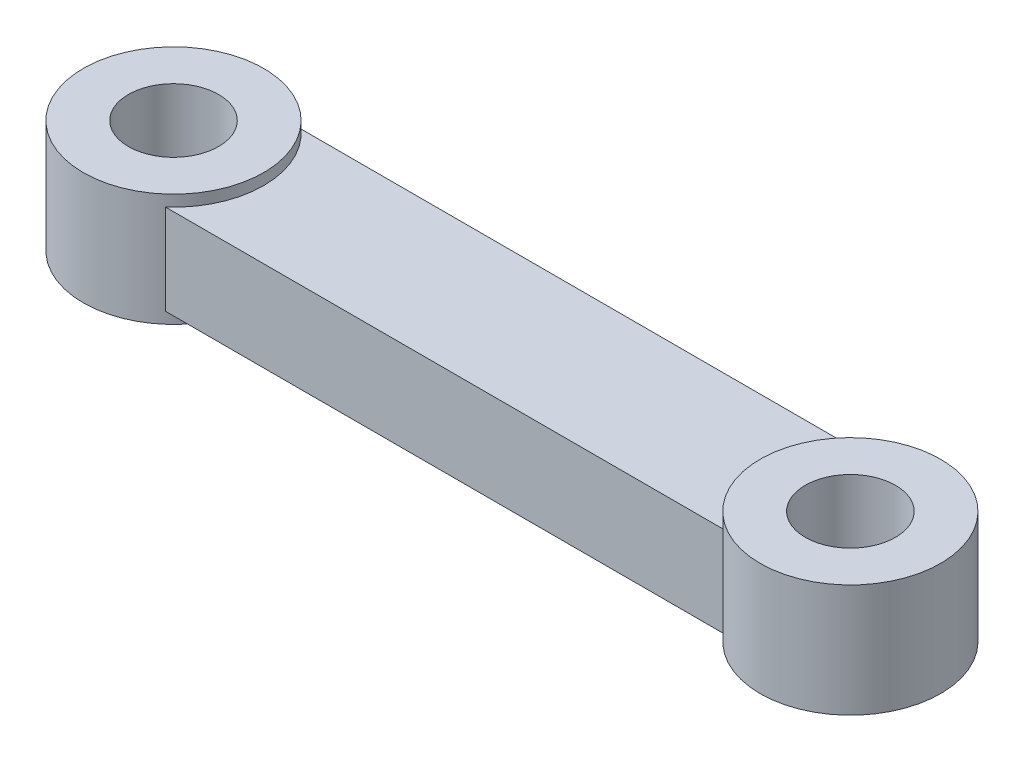
ISO-10303-21;
HEADER;
FILE_DESCRIPTION(('STEP AP214'),'2;1');
FILE_NAME('part.step','',(''),(''),'','','');
FILE_SCHEMA(('AUTOMOTIVE_DESIGN { 1 0 10303 214 1 1 1 1 }'));
ENDSEC;
DATA;
#1=APPLICATION_CONTEXT('core data for automotive mechanical design processes');
#2=APPLICATION_PROTOCOL_DEFINITION('international standard','automotive_design',2000,#1);
#3=PRODUCT_CONTEXT('',#1,'mechanical');
#4=PRODUCT('Part','Part','',(#3));
#5=PRODUCT_RELATED_PRODUCT_CATEGORY('part','',(#4));
#6=PRODUCT_DEFINITION_FORMATION('','',#4);
#7=PRODUCT_DEFINITION_CONTEXT('part definition',#1,'design');
#8=PRODUCT_DEFINITION('design','',#6,#7);
#9=PRODUCT_DEFINITION_SHAPE('','',#8);
#10=(LENGTH_UNIT() NAMED_UNIT(*) SI_UNIT(.MILLI.,.METRE.));
#11=(NAMED_UNIT(*) PLANE_ANGLE_UNIT() SI_UNIT($,.RADIAN.));
#12=(NAMED_UNIT(*) SI_UNIT($,.STERADIAN.) SOLID_ANGLE_UNIT());
#13=UNCERTAINTY_MEASURE_WITH_UNIT(LENGTH_MEASURE(1.E-05),#10,'distance_accuracy_value','');
#14=(GEOMETRIC_REPRESENTATION_CONTEXT(3) GLOBAL_UNCERTAINTY_ASSIGNED_CONTEXT((#13)) GLOBAL_UNIT_ASSIGNED_CONTEXT((#10,
#11,#12)) REPRESENTATION_CONTEXT('',''));
#15=CARTESIAN_POINT('',(0.,0.,0.));
#16=DIRECTION('',(0.,0.,1.));
#17=DIRECTION('',(1.,0.,0.));
#18=AXIS2_PLACEMENT_3D('',#15,#16,#17);
#19=CARTESIAN_POINT('',(0.,10.,0.));
#20=DIRECTION('',(0.,1.,0.));
#21=DIRECTION('',(0.,0.,1.));
#22=AXIS2_PLACEMENT_3D('',#19,#20,#21);
#23=PLANE('',#22);
#24=CARTESIAN_POINT('',(0.,10.,0.));
#25=DIRECTION('',(0.,1.,0.));
#26=DIRECTION('',(0.,0.,1.));
#27=AXIS2_PLACEMENT_3D('',#24,#25,#26);
#28=CIRCLE('',#27,8.);
#29=CARTESIAN_POINT('',(0.,10.,8.));
#30=VERTEX_POINT('',#29);
#31=EDGE_CURVE('E11',#30,#30,#28,.T.);
#32=ORIENTED_EDGE('',*,*,#31,.T.);
#33=EDGE_LOOP('',(#32));
#34=FACE_BOUND('',#33,.T.);
#35=CARTESIAN_POINT('',(0.,10.,0.));
#36=DIRECTION('',(0.,1.,0.));
#37=DIRECTION('',(0.,0.,1.));
#38=AXIS2_PLACEMENT_3D('',#35,#36,#37);
#39=CIRCLE('',#38,4.);
#40=CARTESIAN_POINT('',(0.,10.,4.));
#41=VERTEX_POINT('',#40);
#42=EDGE_CURVE('E121',#41,#41,#39,.T.);
#43=ORIENTED_EDGE('',*,*,#42,.F.);
#44=EDGE_LOOP('',(#43));
#45=FACE_BOUND('',#44,.T.);
#46=ADVANCED_FACE('F39',(#34,#45),#23,.T.);
#47=CARTESIAN_POINT('',(0.,0.,0.));
#48=DIRECTION('',(0.,1.,0.));
#49=DIRECTION('',(0.,0.,1.));
#50=AXIS2_PLACEMENT_3D('',#47,#48,#49);
#51=PLANE('',#50);
#52=CARTESIAN_POINT('',(0.,0.,0.));
#53=DIRECTION('',(0.,1.,0.));
#54=DIRECTION('',(0.,0.,1.));
#55=AXIS2_PLACEMENT_3D('',#52,#53,#54);
#56=CIRCLE('',#55,8.);
#57=CARTESIAN_POINT('',(0.,0.,8.));
#58=VERTEX_POINT('',#57);
#59=EDGE_CURVE('E43',#58,#58,#56,.T.);
#60=ORIENTED_EDGE('',*,*,#59,.F.);
#61=EDGE_LOOP('',(#60));
#62=FACE_BOUND('',#61,.T.);
#63=CARTESIAN_POINT('',(0.,0.,0.));
#64=DIRECTION('',(0.,1.,0.));
#65=DIRECTION('',(0.,0.,1.));
#66=AXIS2_PLACEMENT_3D('',#63,#64,#65);
#67=CIRCLE('',#66,4.);
#68=CARTESIAN_POINT('',(0.,0.,4.));
#69=VERTEX_POINT('',#68);
#70=EDGE_CURVE('E120',#69,#69,#67,.T.);
#71=ORIENTED_EDGE('',*,*,#70,.T.);
#72=EDGE_LOOP('',(#71));
#73=FACE_BOUND('',#72,.T.);
#74=ADVANCED_FACE('F129',(#62,#73),#51,.F.);
#75=CARTESIAN_POINT('',(0.,10.,0.));
#76=DIRECTION('',(0.,-1.,0.));
#77=DIRECTION('',(0.,0.,-1.));
#78=AXIS2_PLACEMENT_3D('',#75,#76,#77);
#79=CYLINDRICAL_SURFACE('',#78,8.);
#80=DIRECTION('',(0.,-1.,0.));
#81=VECTOR('',#80,1.);
#82=CARTESIAN_POINT('',(5.29150262212918,9.,6.));
#83=LINE('',#82,#81);
#84=CARTESIAN_POINT('',(5.29150262212918,9.,6.));
#85=VERTEX_POINT('',#84);
#86=CARTESIAN_POINT('',(5.29150262212918,0.999999999999999,6.));
#87=VERTEX_POINT('',#86);
#88=EDGE_CURVE('E55',#85,#87,#83,.T.);
#89=ORIENTED_EDGE('',*,*,#88,.F.);
#90=CARTESIAN_POINT('',(0.,9.,0.));
#91=DIRECTION('',(0.,-1.,0.));
#92=DIRECTION('',(0.,0.,1.));
#93=AXIS2_PLACEMENT_3D('',#90,#91,#92);
#94=CIRCLE('',#93,8.);
#95=CARTESIAN_POINT('',(5.29150262212918,9.,-6.));
#96=VERTEX_POINT('',#95);
#97=EDGE_CURVE('E60',#96,#85,#94,.T.);
#98=ORIENTED_EDGE('',*,*,#97,.F.);
#99=DIRECTION('',(0.,-1.,0.));
#100=VECTOR('',#99,1.);
#101=CARTESIAN_POINT('',(5.29150262212918,9.,-6.));
#102=LINE('',#101,#100);
#103=CARTESIAN_POINT('',(5.29150262212918,1.,-6.));
#104=VERTEX_POINT('',#103);
#105=EDGE_CURVE('E102',#96,#104,#102,.T.);
#106=ORIENTED_EDGE('',*,*,#105,.T.);
#107=CARTESIAN_POINT('',(0.,1.,0.));
#108=DIRECTION('',(0.,-1.,0.));
#109=DIRECTION('',(0.,0.,1.));
#110=AXIS2_PLACEMENT_3D('',#107,#108,#109);
#111=CIRCLE('',#110,8.);
#112=EDGE_CURVE('E88',#104,#87,#111,.T.);
#113=ORIENTED_EDGE('',*,*,#112,.T.);
#114=EDGE_LOOP('',(#89,#98,#106,#113));
#115=FACE_BOUND('',#114,.T.);
#116=ORIENTED_EDGE('',*,*,#31,.F.);
#117=EDGE_LOOP('',(#116));
#118=FACE_BOUND('',#117,.T.);
#119=ORIENTED_EDGE('',*,*,#59,.T.);
#120=EDGE_LOOP('',(#119));
#121=FACE_BOUND('',#120,.T.);
#122=ADVANCED_FACE('F41',(#115,#118,#121),#79,.T.);
#123=CARTESIAN_POINT('',(0.,10.,0.));
#124=DIRECTION('',(0.,-1.,0.));
#125=DIRECTION('',(0.,0.,-1.));
#126=AXIS2_PLACEMENT_3D('',#123,#124,#125);
#127=CYLINDRICAL_SURFACE('',#126,4.);
#128=ORIENTED_EDGE('',*,*,#42,.T.);
#129=EDGE_LOOP('',(#128));
#130=FACE_BOUND('',#129,.T.);
#131=ORIENTED_EDGE('',*,*,#70,.F.);
#132=EDGE_LOOP('',(#131));
#133=FACE_BOUND('',#132,.T.);
#134=ADVANCED_FACE('F131',(#130,#133),#127,.F.);
#135=CARTESIAN_POINT('',(5.29150262212918,9.,6.));
#136=DIRECTION('',(0.,0.,-1.));
#137=DIRECTION('',(-1.,0.,0.));
#138=AXIS2_PLACEMENT_3D('',#135,#136,#137);
#139=PLANE('',#138);
#140=DIRECTION('',(1.,0.,0.));
#141=VECTOR('',#140,1.);
#142=CARTESIAN_POINT('',(5.29150262212918,1.,6.));
#143=LINE('',#142,#141);
#144=CARTESIAN_POINT('',(54.7084973778708,1.,6.));
#145=VERTEX_POINT('',#144);
#146=EDGE_CURVE('E108',#87,#145,#143,.T.);
#147=ORIENTED_EDGE('',*,*,#146,.T.);
#148=DIRECTION('',(0.,-1.,0.));
#149=VECTOR('',#148,1.);
#150=CARTESIAN_POINT('',(54.7084973778708,9.,6.));
#151=LINE('',#150,#149);
#152=CARTESIAN_POINT('',(54.7084973778708,9.,6.));
#153=VERTEX_POINT('',#152);
#154=EDGE_CURVE('E101',#153,#145,#151,.T.);
#155=ORIENTED_EDGE('',*,*,#154,.F.);
#156=DIRECTION('',(1.,0.,0.));
#157=VECTOR('',#156,1.);
#158=CARTESIAN_POINT('',(5.29150262212918,9.,6.));
#159=LINE('',#158,#157);
#160=EDGE_CURVE('E262',#85,#153,#159,.T.);
#161=ORIENTED_EDGE('',*,*,#160,.F.);
#162=ORIENTED_EDGE('',*,*,#88,.T.);
#163=EDGE_LOOP('',(#147,#155,#161,#162));
#164=FACE_BOUND('',#163,.T.);
#165=ADVANCED_FACE('F133',(#164),#139,.F.);
#166=CARTESIAN_POINT('',(5.29150262212918,9.,-6.));
#167=DIRECTION('',(0.,0.,1.));
#168=DIRECTION('',(1.,0.,0.));
#169=AXIS2_PLACEMENT_3D('',#166,#167,#168);
#170=PLANE('',#169);
#171=DIRECTION('',(-1.,0.,0.));
#172=VECTOR('',#171,1.);
#173=CARTESIAN_POINT('',(5.29150262212918,1.,-6.));
#174=LINE('',#173,#172);
#175=CARTESIAN_POINT('',(54.7084973778708,0.999999999999999,-6.));
#176=VERTEX_POINT('',#175);
#177=EDGE_CURVE('E81',#176,#104,#174,.T.);
#178=ORIENTED_EDGE('',*,*,#177,.T.);
#179=ORIENTED_EDGE('',*,*,#105,.F.);
#180=DIRECTION('',(-1.,0.,0.));
#181=VECTOR('',#180,1.);
#182=CARTESIAN_POINT('',(5.29150262212918,9.,-6.));
#183=LINE('',#182,#181);
#184=CARTESIAN_POINT('',(54.7084973778708,9.,-6.));
#185=VERTEX_POINT('',#184);
#186=EDGE_CURVE('E97',#185,#96,#183,.T.);
#187=ORIENTED_EDGE('',*,*,#186,.F.);
#188=DIRECTION('',(0.,-1.,0.));
#189=VECTOR('',#188,1.);
#190=CARTESIAN_POINT('',(54.7084973778708,9.,-6.));
#191=LINE('',#190,#189);
#192=EDGE_CURVE('E95',#185,#176,#191,.T.);
#193=ORIENTED_EDGE('',*,*,#192,.T.);
#194=EDGE_LOOP('',(#178,#179,#187,#193));
#195=FACE_BOUND('',#194,.T.);
#196=ADVANCED_FACE('F96',(#195),#170,.F.);
#197=CARTESIAN_POINT('',(0.,9.,0.));
#198=DIRECTION('',(0.,1.,0.));
#199=DIRECTION('',(0.,0.,1.));
#200=AXIS2_PLACEMENT_3D('',#197,#198,#199);
#201=PLANE('',#200);
#202=ORIENTED_EDGE('',*,*,#97,.T.);
#203=ORIENTED_EDGE('',*,*,#160,.T.);
#204=CARTESIAN_POINT('',(60.,9.,0.));
#205=DIRECTION('',(0.,-1.,0.));
#206=DIRECTION('',(0.,0.,1.));
#207=AXIS2_PLACEMENT_3D('',#204,#205,#206);
#208=CIRCLE('',#207,8.);
#209=EDGE_CURVE('E265',#153,#185,#208,.T.);
#210=ORIENTED_EDGE('',*,*,#209,.T.);
#211=ORIENTED_EDGE('',*,*,#186,.T.);
#212=EDGE_LOOP('',(#202,#203,#210,#211));
#213=FACE_BOUND('',#212,.T.);
#214=ADVANCED_FACE('F181',(#213),#201,.T.);
#215=CARTESIAN_POINT('',(0.,1.,0.));
#216=DIRECTION('',(0.,1.,0.));
#217=DIRECTION('',(0.,0.,1.));
#218=AXIS2_PLACEMENT_3D('',#215,#216,#217);
#219=PLANE('',#218);
#220=ORIENTED_EDGE('',*,*,#112,.F.);
#221=ORIENTED_EDGE('',*,*,#177,.F.);
#222=CARTESIAN_POINT('',(60.,1.,0.));
#223=DIRECTION('',(0.,-1.,0.));
#224=DIRECTION('',(0.,0.,1.));
#225=AXIS2_PLACEMENT_3D('',#222,#223,#224);
#226=CIRCLE('',#225,8.);
#227=EDGE_CURVE('E86',#145,#176,#226,.T.);
#228=ORIENTED_EDGE('',*,*,#227,.F.);
#229=ORIENTED_EDGE('',*,*,#146,.F.);
#230=EDGE_LOOP('',(#220,#221,#228,#229));
#231=FACE_BOUND('',#230,.T.);
#232=ADVANCED_FACE('F83',(#231),#219,.F.);
#233=CARTESIAN_POINT('',(60.,10.,0.));
#234=DIRECTION('',(0.,1.,0.));
#235=DIRECTION('',(0.,0.,1.));
#236=AXIS2_PLACEMENT_3D('',#233,#234,#235);
#237=PLANE('',#236);
#238=CARTESIAN_POINT('',(60.,10.,0.));
#239=DIRECTION('',(0.,1.,0.));
#240=DIRECTION('',(0.,0.,1.));
#241=AXIS2_PLACEMENT_3D('',#238,#239,#240);
#242=CIRCLE('',#241,8.);
#243=CARTESIAN_POINT('',(60.,10.,8.));
#244=VERTEX_POINT('',#243);
#245=EDGE_CURVE('E253',#244,#244,#242,.T.);
#246=ORIENTED_EDGE('',*,*,#245,.T.);
#247=EDGE_LOOP('',(#246));
#248=FACE_BOUND('',#247,.T.);
#249=CARTESIAN_POINT('',(60.,10.,0.));
#250=DIRECTION('',(0.,1.,0.));
#251=DIRECTION('',(0.,0.,1.));
#252=AXIS2_PLACEMENT_3D('',#249,#250,#251);
#253=CIRCLE('',#252,4.00000000000001);
#254=CARTESIAN_POINT('',(60.,10.,4.00000000000001));
#255=VERTEX_POINT('',#254);
#256=EDGE_CURVE('E242',#255,#255,#253,.T.);
#257=ORIENTED_EDGE('',*,*,#256,.F.);
#258=EDGE_LOOP('',(#257));
#259=FACE_BOUND('',#258,.T.);
#260=ADVANCED_FACE('F199',(#248,#259),#237,.T.);
#261=CARTESIAN_POINT('',(60.,0.,0.));
#262=DIRECTION('',(0.,1.,0.));
#263=DIRECTION('',(0.,0.,1.));
#264=AXIS2_PLACEMENT_3D('',#261,#262,#263);
#265=PLANE('',#264);
#266=CARTESIAN_POINT('',(60.,0.,0.));
#267=DIRECTION('',(0.,1.,0.));
#268=DIRECTION('',(0.,0.,1.));
#269=AXIS2_PLACEMENT_3D('',#266,#267,#268);
#270=CIRCLE('',#269,8.);
#271=CARTESIAN_POINT('',(60.,0.,8.));
#272=VERTEX_POINT('',#271);
#273=EDGE_CURVE('E250',#272,#272,#270,.T.);
#274=ORIENTED_EDGE('',*,*,#273,.F.);
#275=EDGE_LOOP('',(#274));
#276=FACE_BOUND('',#275,.T.);
#277=CARTESIAN_POINT('',(60.,0.,0.));
#278=DIRECTION('',(0.,1.,0.));
#279=DIRECTION('',(0.,0.,1.));
#280=AXIS2_PLACEMENT_3D('',#277,#278,#279);
#281=CIRCLE('',#280,4.00000000000001);
#282=CARTESIAN_POINT('',(60.,0.,4.00000000000001));
#283=VERTEX_POINT('',#282);
#284=EDGE_CURVE('E245',#283,#283,#281,.T.);
#285=ORIENTED_EDGE('',*,*,#284,.T.);
#286=EDGE_LOOP('',(#285));
#287=FACE_BOUND('',#286,.T.);
#288=ADVANCED_FACE('F208',(#276,#287),#265,.F.);
#289=CARTESIAN_POINT('',(60.,10.,0.));
#290=DIRECTION('',(0.,-1.,0.));
#291=DIRECTION('',(0.,0.,-1.));
#292=AXIS2_PLACEMENT_3D('',#289,#290,#291);
#293=CYLINDRICAL_SURFACE('',#292,8.);
#294=ORIENTED_EDGE('',*,*,#209,.F.);
#295=ORIENTED_EDGE('',*,*,#154,.T.);
#296=ORIENTED_EDGE('',*,*,#227,.T.);
#297=ORIENTED_EDGE('',*,*,#192,.F.);
#298=EDGE_LOOP('',(#294,#295,#296,#297));
#299=FACE_BOUND('',#298,.T.);
#300=ORIENTED_EDGE('',*,*,#245,.F.);
#301=EDGE_LOOP('',(#300));
#302=FACE_BOUND('',#301,.T.);
#303=ORIENTED_EDGE('',*,*,#273,.T.);
#304=EDGE_LOOP('',(#303));
#305=FACE_BOUND('',#304,.T.);
#306=ADVANCED_FACE('F104',(#299,#302,#305),#293,.T.);
#307=CARTESIAN_POINT('',(60.,10.,0.));
#308=DIRECTION('',(0.,-1.,0.));
#309=DIRECTION('',(0.,0.,-1.));
#310=AXIS2_PLACEMENT_3D('',#307,#308,#309);
#311=CYLINDRICAL_SURFACE('',#310,4.00000000000001);
#312=ORIENTED_EDGE('',*,*,#256,.T.);
#313=EDGE_LOOP('',(#312));
#314=FACE_BOUND('',#313,.T.);
#315=ORIENTED_EDGE('',*,*,#284,.F.);
#316=EDGE_LOOP('',(#315));
#317=FACE_BOUND('',#316,.T.);
#318=ADVANCED_FACE('F227',(#314,#317),#311,.F.);
#319=CLOSED_SHELL('',(#46,#74,#122,#134,#165,#196,#214,#232,#260,#288,#306,#318));
#320=MANIFOLD_SOLID_BREP('B2',#319);
#321=ADVANCED_BREP_SHAPE_REPRESENTATION('',(#18,#320),#14);
#322=SHAPE_DEFINITION_REPRESENTATION(#9,#321);
ENDSEC;
END-ISO-10303-21;
